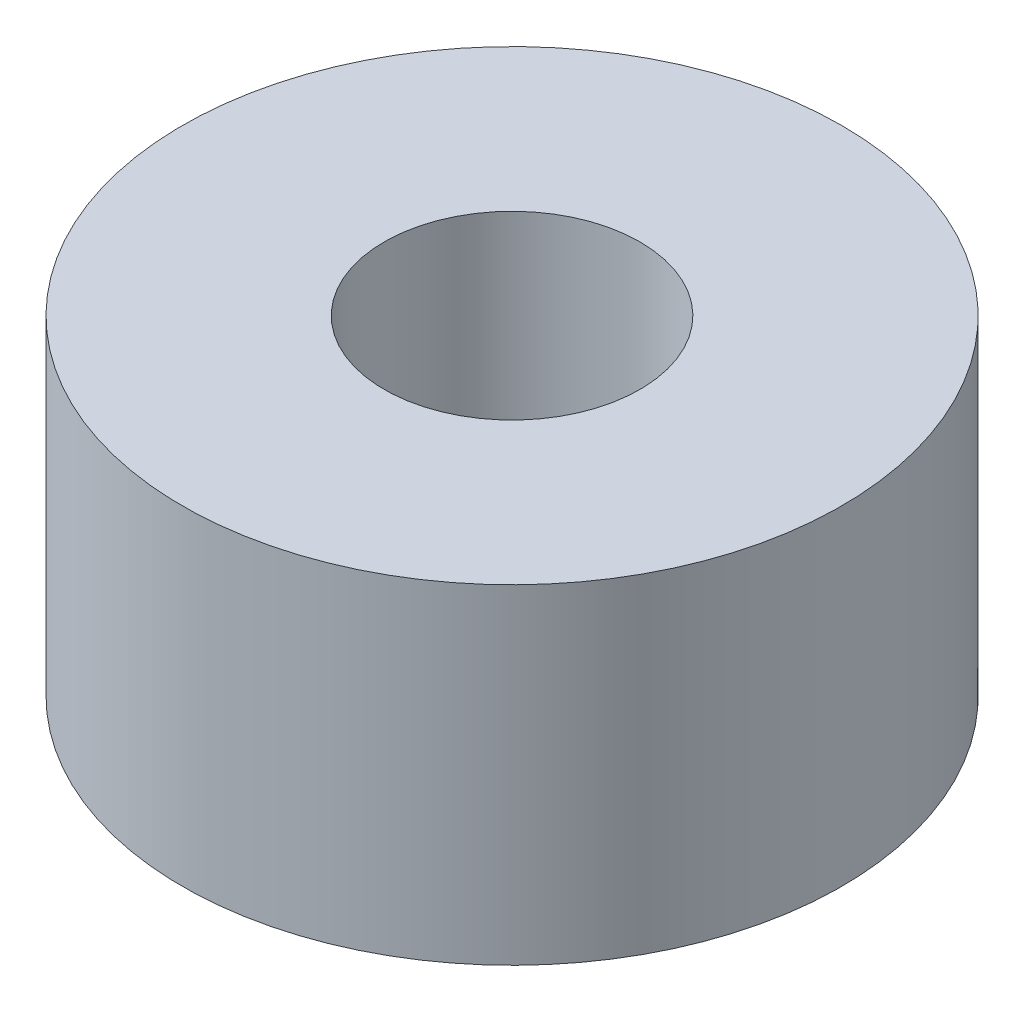
ISO-10303-21;
HEADER;
FILE_DESCRIPTION(('STEP AP214'),'2;1');
FILE_NAME('part.step','',(''),(''),'','','');
FILE_SCHEMA(('AUTOMOTIVE_DESIGN { 1 0 10303 214 1 1 1 1 }'));
ENDSEC;
DATA;
#1=APPLICATION_CONTEXT('core data for automotive mechanical design processes');
#2=APPLICATION_PROTOCOL_DEFINITION('international standard','automotive_design',2000,#1);
#3=PRODUCT_CONTEXT('',#1,'mechanical');
#4=PRODUCT('Part','Part','',(#3));
#5=PRODUCT_RELATED_PRODUCT_CATEGORY('part','',(#4));
#6=PRODUCT_DEFINITION_FORMATION('','',#4);
#7=PRODUCT_DEFINITION_CONTEXT('part definition',#1,'design');
#8=PRODUCT_DEFINITION('design','',#6,#7);
#9=PRODUCT_DEFINITION_SHAPE('','',#8);
#10=(LENGTH_UNIT() NAMED_UNIT(*) SI_UNIT(.MILLI.,.METRE.));
#11=(NAMED_UNIT(*) PLANE_ANGLE_UNIT() SI_UNIT($,.RADIAN.));
#12=(NAMED_UNIT(*) SI_UNIT($,.STERADIAN.) SOLID_ANGLE_UNIT());
#13=UNCERTAINTY_MEASURE_WITH_UNIT(LENGTH_MEASURE(1.E-05),#10,'distance_accuracy_value','');
#14=(GEOMETRIC_REPRESENTATION_CONTEXT(3) GLOBAL_UNCERTAINTY_ASSIGNED_CONTEXT((#13)) GLOBAL_UNIT_ASSIGNED_CONTEXT((#10,
#11,#12)) REPRESENTATION_CONTEXT('',''));
#15=CARTESIAN_POINT('',(0.,0.,0.));
#16=DIRECTION('',(0.,0.,1.));
#17=DIRECTION('',(1.,0.,0.));
#18=AXIS2_PLACEMENT_3D('',#15,#16,#17);
#19=CARTESIAN_POINT('',(0.,3.175,0.));
#20=DIRECTION('',(0.,-1.,0.));
#21=DIRECTION('',(0.,0.,-1.));
#22=AXIS2_PLACEMENT_3D('',#19,#20,#21);
#23=CYLINDRICAL_SURFACE('',#22,2.4638);
#24=CARTESIAN_POINT('',(0.,-3.175,0.));
#25=DIRECTION('',(0.,-1.,0.));
#26=DIRECTION('',(0.,0.,-1.));
#27=AXIS2_PLACEMENT_3D('',#24,#25,#26);
#28=CIRCLE('',#27,2.4638);
#29=CARTESIAN_POINT('',(0.,-3.175,-2.4638));
#30=VERTEX_POINT('',#29);
#31=EDGE_CURVE('E26',#30,#30,#28,.T.);
#32=ORIENTED_EDGE('',*,*,#31,.T.);
#33=EDGE_LOOP('',(#32));
#34=FACE_BOUND('',#33,.T.);
#35=CARTESIAN_POINT('',(0.,3.175,0.));
#36=DIRECTION('',(0.,-1.,0.));
#37=DIRECTION('',(0.,0.,-1.));
#38=AXIS2_PLACEMENT_3D('',#35,#36,#37);
#39=CIRCLE('',#38,2.4638);
#40=CARTESIAN_POINT('',(0.,3.175,-2.4638));
#41=VERTEX_POINT('',#40);
#42=EDGE_CURVE('E17',#41,#41,#39,.T.);
#43=ORIENTED_EDGE('',*,*,#42,.F.);
#44=EDGE_LOOP('',(#43));
#45=FACE_BOUND('',#44,.T.);
#46=ADVANCED_FACE('F14',(#34,#45),#23,.F.);
#47=CARTESIAN_POINT('',(0.,3.175,0.));
#48=DIRECTION('',(0.,1.,0.));
#49=DIRECTION('',(0.,0.,1.));
#50=AXIS2_PLACEMENT_3D('',#47,#48,#49);
#51=PLANE('',#50);
#52=ORIENTED_EDGE('',*,*,#42,.T.);
#53=EDGE_LOOP('',(#52));
#54=FACE_BOUND('',#53,.T.);
#55=CARTESIAN_POINT('',(0.,3.175,0.));
#56=DIRECTION('',(0.,-1.,0.));
#57=DIRECTION('',(0.,0.,-1.));
#58=AXIS2_PLACEMENT_3D('',#55,#56,#57);
#59=CIRCLE('',#58,6.35);
#60=CARTESIAN_POINT('',(0.,3.175,-6.35));
#61=VERTEX_POINT('',#60);
#62=EDGE_CURVE('E21',#61,#61,#59,.T.);
#63=ORIENTED_EDGE('',*,*,#62,.F.);
#64=EDGE_LOOP('',(#63));
#65=FACE_BOUND('',#64,.T.);
#66=ADVANCED_FACE('F34',(#54,#65),#51,.T.);
#67=CARTESIAN_POINT('',(0.,-3.175,0.));
#68=DIRECTION('',(0.,1.,0.));
#69=DIRECTION('',(0.,0.,1.));
#70=AXIS2_PLACEMENT_3D('',#67,#68,#69);
#71=PLANE('',#70);
#72=ORIENTED_EDGE('',*,*,#31,.F.);
#73=EDGE_LOOP('',(#72));
#74=FACE_BOUND('',#73,.T.);
#75=CARTESIAN_POINT('',(0.,-3.175,0.));
#76=DIRECTION('',(0.,-1.,0.));
#77=DIRECTION('',(0.,0.,-1.));
#78=AXIS2_PLACEMENT_3D('',#75,#76,#77);
#79=CIRCLE('',#78,6.35);
#80=CARTESIAN_POINT('',(0.,-3.175,-6.35));
#81=VERTEX_POINT('',#80);
#82=EDGE_CURVE('E10',#81,#81,#79,.F.);
#83=ORIENTED_EDGE('',*,*,#82,.F.);
#84=EDGE_LOOP('',(#83));
#85=FACE_BOUND('',#84,.T.);
#86=ADVANCED_FACE('F42',(#74,#85),#71,.F.);
#87=CARTESIAN_POINT('',(0.,3.175,0.));
#88=DIRECTION('',(0.,-1.,0.));
#89=DIRECTION('',(0.,0.,-1.));
#90=AXIS2_PLACEMENT_3D('',#87,#88,#89);
#91=CYLINDRICAL_SURFACE('',#90,6.35);
#92=ORIENTED_EDGE('',*,*,#62,.T.);
#93=EDGE_LOOP('',(#92));
#94=FACE_BOUND('',#93,.T.);
#95=ORIENTED_EDGE('',*,*,#82,.T.);
#96=EDGE_LOOP('',(#95));
#97=FACE_BOUND('',#96,.T.);
#98=ADVANCED_FACE('F43',(#94,#97),#91,.T.);
#99=CLOSED_SHELL('',(#46,#66,#86,#98));
#100=MANIFOLD_SOLID_BREP('B1',#99);
#101=ADVANCED_BREP_SHAPE_REPRESENTATION('',(#18,#100),#14);
#102=SHAPE_DEFINITION_REPRESENTATION(#9,#101);
ENDSEC;
END-ISO-10303-21;
